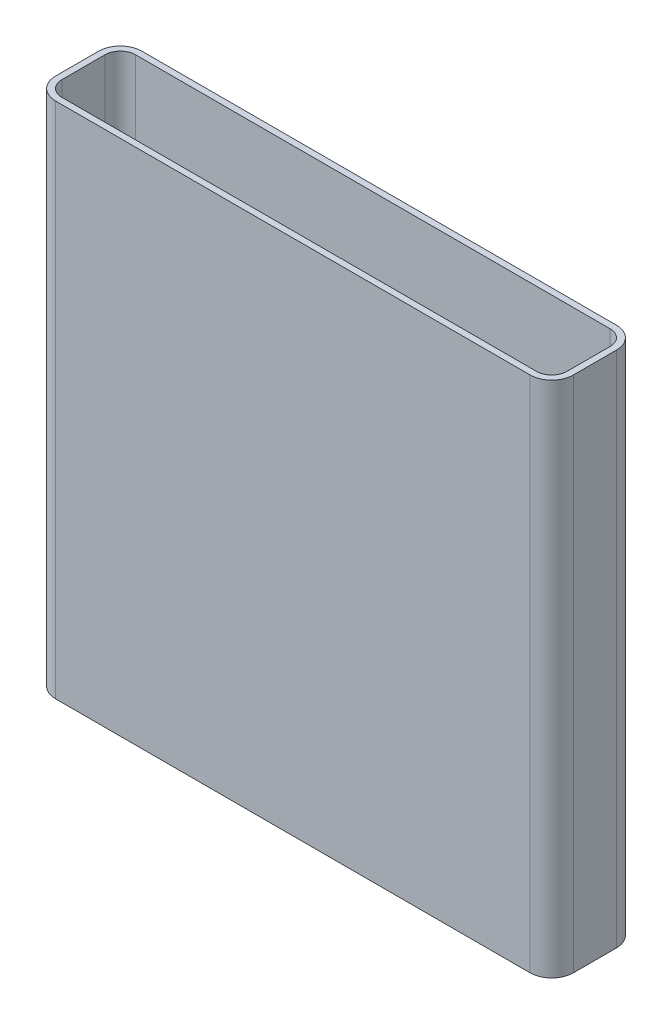
ISO-10303-21;
HEADER;
FILE_DESCRIPTION(('STEP AP214'),'2;1');
FILE_NAME('part.step','',(''),(''),'','','');
FILE_SCHEMA(('AUTOMOTIVE_DESIGN { 1 0 10303 214 1 1 1 1 }'));
ENDSEC;
DATA;
#1=APPLICATION_CONTEXT('core data for automotive mechanical design processes');
#2=APPLICATION_PROTOCOL_DEFINITION('international standard','automotive_design',2000,#1);
#3=PRODUCT_CONTEXT('',#1,'mechanical');
#4=PRODUCT('Part','Part','',(#3));
#5=PRODUCT_RELATED_PRODUCT_CATEGORY('part','',(#4));
#6=PRODUCT_DEFINITION_FORMATION('','',#4);
#7=PRODUCT_DEFINITION_CONTEXT('part definition',#1,'design');
#8=PRODUCT_DEFINITION('design','',#6,#7);
#9=PRODUCT_DEFINITION_SHAPE('','',#8);
#10=(LENGTH_UNIT() NAMED_UNIT(*) SI_UNIT(.MILLI.,.METRE.));
#11=(NAMED_UNIT(*) PLANE_ANGLE_UNIT() SI_UNIT($,.RADIAN.));
#12=(NAMED_UNIT(*) SI_UNIT($,.STERADIAN.) SOLID_ANGLE_UNIT());
#13=UNCERTAINTY_MEASURE_WITH_UNIT(LENGTH_MEASURE(1.E-05),#10,'distance_accuracy_value','');
#14=(GEOMETRIC_REPRESENTATION_CONTEXT(3) GLOBAL_UNCERTAINTY_ASSIGNED_CONTEXT((#13)) GLOBAL_UNIT_ASSIGNED_CONTEXT((#10,
#11,#12)) REPRESENTATION_CONTEXT('',''));
#15=CARTESIAN_POINT('',(0.,0.,0.));
#16=DIRECTION('',(0.,0.,1.));
#17=DIRECTION('',(1.,0.,0.));
#18=AXIS2_PLACEMENT_3D('',#15,#16,#17);
#19=CARTESIAN_POINT('',(838.2,1828.8,-76.2));
#20=DIRECTION('',(0.,1.,0.));
#21=DIRECTION('',(0.,0.,1.));
#22=AXIS2_PLACEMENT_3D('',#19,#20,#21);
#23=PLANE('',#22);
#24=CARTESIAN_POINT('',(838.2,1828.8,-76.2));
#25=DIRECTION('',(0.,1.,0.));
#26=DIRECTION('',(0.,0.,-1.));
#27=AXIS2_PLACEMENT_3D('',#24,#25,#26);
#28=CIRCLE('',#27,76.2);
#29=CARTESIAN_POINT('',(914.4,1828.8,-76.1999999999995));
#30=VERTEX_POINT('',#29);
#31=CARTESIAN_POINT('',(838.2,1828.8,-152.4));
#32=VERTEX_POINT('',#31);
#33=EDGE_CURVE('E290',#30,#32,#28,.T.);
#34=ORIENTED_EDGE('',*,*,#33,.T.);
#35=DIRECTION('',(-1.,0.,0.));
#36=VECTOR('',#35,1.);
#37=CARTESIAN_POINT('',(-838.199999999999,1828.8,-152.4));
#38=LINE('',#37,#36);
#39=CARTESIAN_POINT('',(-838.199999999999,1828.8,-152.4));
#40=VERTEX_POINT('',#39);
#41=EDGE_CURVE('E294',#32,#40,#38,.T.);
#42=ORIENTED_EDGE('',*,*,#41,.T.);
#43=CARTESIAN_POINT('',(-838.2,1828.8,-76.2));
#44=DIRECTION('',(0.,1.,0.));
#45=DIRECTION('',(0.,0.,1.));
#46=AXIS2_PLACEMENT_3D('',#43,#44,#45);
#47=CIRCLE('',#46,76.2);
#48=CARTESIAN_POINT('',(-914.4,1828.8,-76.1999999999995));
#49=VERTEX_POINT('',#48);
#50=EDGE_CURVE('E298',#40,#49,#47,.T.);
#51=ORIENTED_EDGE('',*,*,#50,.T.);
#52=DIRECTION('',(0.,0.,1.));
#53=VECTOR('',#52,1.);
#54=CARTESIAN_POINT('',(-914.4,1828.8,-76.1999999999995));
#55=LINE('',#54,#53);
#56=CARTESIAN_POINT('',(-914.4,1828.8,76.1999999999995));
#57=VERTEX_POINT('',#56);
#58=EDGE_CURVE('E301',#49,#57,#55,.T.);
#59=ORIENTED_EDGE('',*,*,#58,.T.);
#60=CARTESIAN_POINT('',(-838.199999999999,1828.8,76.2));
#61=DIRECTION('',(0.,1.,0.));
#62=DIRECTION('',(0.,0.,1.));
#63=AXIS2_PLACEMENT_3D('',#60,#61,#62);
#64=CIRCLE('',#63,76.2);
#65=CARTESIAN_POINT('',(-838.199999999999,1828.8,152.4));
#66=VERTEX_POINT('',#65);
#67=EDGE_CURVE('E304',#57,#66,#64,.T.);
#68=ORIENTED_EDGE('',*,*,#67,.T.);
#69=DIRECTION('',(1.,0.,0.));
#70=VECTOR('',#69,1.);
#71=CARTESIAN_POINT('',(-838.199999999999,1828.8,152.4));
#72=LINE('',#71,#70);
#73=CARTESIAN_POINT('',(838.2,1828.8,152.4));
#74=VERTEX_POINT('',#73);
#75=EDGE_CURVE('E307',#66,#74,#72,.T.);
#76=ORIENTED_EDGE('',*,*,#75,.T.);
#77=CARTESIAN_POINT('',(838.200000000001,1828.8,76.2));
#78=DIRECTION('',(0.,1.,0.));
#79=DIRECTION('',(0.,0.,1.));
#80=AXIS2_PLACEMENT_3D('',#77,#78,#79);
#81=CIRCLE('',#80,76.2);
#82=CARTESIAN_POINT('',(914.4,1828.8,76.1999999999995));
#83=VERTEX_POINT('',#82);
#84=EDGE_CURVE('E310',#74,#83,#81,.T.);
#85=ORIENTED_EDGE('',*,*,#84,.T.);
#86=DIRECTION('',(0.,0.,-1.));
#87=VECTOR('',#86,1.);
#88=CARTESIAN_POINT('',(914.4,1828.8,-76.1999999999995));
#89=LINE('',#88,#87);
#90=EDGE_CURVE('E313',#83,#30,#89,.T.);
#91=ORIENTED_EDGE('',*,*,#90,.T.);
#92=EDGE_LOOP('',(#34,#42,#51,#59,#68,#76,#85,#91));
#93=FACE_BOUND('',#92,.T.);
#94=DIRECTION('',(-1.,0.,0.));
#95=VECTOR('',#94,1.);
#96=CARTESIAN_POINT('',(838.2,1828.8,-130.175));
#97=LINE('',#96,#95);
#98=CARTESIAN_POINT('',(838.2,1828.8,-130.175));
#99=VERTEX_POINT('',#98);
#100=CARTESIAN_POINT('',(-838.199999999999,1828.8,-130.175));
#101=VERTEX_POINT('',#100);
#102=EDGE_CURVE('E210',#99,#101,#97,.T.);
#103=ORIENTED_EDGE('',*,*,#102,.F.);
#104=CARTESIAN_POINT('',(838.2,1828.8,-76.2));
#105=DIRECTION('',(0.,-1.,0.));
#106=DIRECTION('',(-1.,0.,0.));
#107=AXIS2_PLACEMENT_3D('',#104,#105,#106);
#108=CIRCLE('',#107,53.975);
#109=CARTESIAN_POINT('',(892.175,1828.8,-76.1999999999995));
#110=VERTEX_POINT('',#109);
#111=EDGE_CURVE('E201',#110,#99,#108,.F.);
#112=ORIENTED_EDGE('',*,*,#111,.F.);
#113=DIRECTION('',(0.,0.,-1.));
#114=VECTOR('',#113,1.);
#115=CARTESIAN_POINT('',(892.175,1828.8,-76.2));
#116=LINE('',#115,#114);
#117=CARTESIAN_POINT('',(892.175,1828.8,76.1999999999996));
#118=VERTEX_POINT('',#117);
#119=EDGE_CURVE('E242',#118,#110,#116,.T.);
#120=ORIENTED_EDGE('',*,*,#119,.F.);
#121=CARTESIAN_POINT('',(838.200000000001,1828.8,76.2));
#122=DIRECTION('',(0.,-1.,0.));
#123=DIRECTION('',(-1.,0.,0.));
#124=AXIS2_PLACEMENT_3D('',#121,#122,#123);
#125=CIRCLE('',#124,53.975);
#126=CARTESIAN_POINT('',(838.2,1828.8,130.175));
#127=VERTEX_POINT('',#126);
#128=EDGE_CURVE('E239',#127,#118,#125,.F.);
#129=ORIENTED_EDGE('',*,*,#128,.F.);
#130=DIRECTION('',(1.,0.,0.));
#131=VECTOR('',#130,1.);
#132=CARTESIAN_POINT('',(838.2,1828.8,130.175));
#133=LINE('',#132,#131);
#134=CARTESIAN_POINT('',(-838.199999999999,1828.8,130.175));
#135=VERTEX_POINT('',#134);
#136=EDGE_CURVE('E236',#135,#127,#133,.T.);
#137=ORIENTED_EDGE('',*,*,#136,.F.);
#138=CARTESIAN_POINT('',(-838.199999999999,1828.8,76.2));
#139=DIRECTION('',(0.,-1.,0.));
#140=DIRECTION('',(-1.,0.,0.));
#141=AXIS2_PLACEMENT_3D('',#138,#139,#140);
#142=CIRCLE('',#141,53.975);
#143=CARTESIAN_POINT('',(-892.174999999999,1828.8,76.1999999999995));
#144=VERTEX_POINT('',#143);
#145=EDGE_CURVE('E233',#144,#135,#142,.F.);
#146=ORIENTED_EDGE('',*,*,#145,.F.);
#147=DIRECTION('',(0.,0.,1.));
#148=VECTOR('',#147,1.);
#149=CARTESIAN_POINT('',(-892.175,1828.8,-76.2));
#150=LINE('',#149,#148);
#151=CARTESIAN_POINT('',(-892.175,1828.8,-76.1999999999996));
#152=VERTEX_POINT('',#151);
#153=EDGE_CURVE('E228',#152,#144,#150,.T.);
#154=ORIENTED_EDGE('',*,*,#153,.F.);
#155=CARTESIAN_POINT('',(-838.2,1828.8,-76.2));
#156=DIRECTION('',(0.,-1.,0.));
#157=DIRECTION('',(-1.,0.,0.));
#158=AXIS2_PLACEMENT_3D('',#155,#156,#157);
#159=CIRCLE('',#158,53.975);
#160=EDGE_CURVE('E224',#101,#152,#159,.F.);
#161=ORIENTED_EDGE('',*,*,#160,.F.);
#162=EDGE_LOOP('',(#103,#112,#120,#129,#137,#146,#154,#161));
#163=FACE_BOUND('',#162,.T.);
#164=ADVANCED_FACE('F87',(#93,#163),#23,.T.);
#165=CARTESIAN_POINT('',(838.2,0.,-76.2));
#166=DIRECTION('',(0.,1.,0.));
#167=DIRECTION('',(0.,0.,1.));
#168=AXIS2_PLACEMENT_3D('',#165,#166,#167);
#169=PLANE('',#168);
#170=CARTESIAN_POINT('',(838.2,0.,-76.2));
#171=DIRECTION('',(0.,1.,0.));
#172=DIRECTION('',(0.,0.,-1.));
#173=AXIS2_PLACEMENT_3D('',#170,#171,#172);
#174=CIRCLE('',#173,76.2);
#175=CARTESIAN_POINT('',(914.4,0.,-76.1999999999995));
#176=VERTEX_POINT('',#175);
#177=CARTESIAN_POINT('',(838.2,0.,-152.4));
#178=VERTEX_POINT('',#177);
#179=EDGE_CURVE('E219',#176,#178,#174,.T.);
#180=ORIENTED_EDGE('',*,*,#179,.F.);
#181=DIRECTION('',(0.,0.,-1.));
#182=VECTOR('',#181,1.);
#183=CARTESIAN_POINT('',(914.4,0.,-76.1999999999995));
#184=LINE('',#183,#182);
#185=CARTESIAN_POINT('',(914.4,0.,76.1999999999995));
#186=VERTEX_POINT('',#185);
#187=EDGE_CURVE('E295',#186,#176,#184,.T.);
#188=ORIENTED_EDGE('',*,*,#187,.F.);
#189=CARTESIAN_POINT('',(838.200000000001,0.,76.2));
#190=DIRECTION('',(0.,1.,0.));
#191=DIRECTION('',(0.,0.,1.));
#192=AXIS2_PLACEMENT_3D('',#189,#190,#191);
#193=CIRCLE('',#192,76.2);
#194=CARTESIAN_POINT('',(838.2,0.,152.4));
#195=VERTEX_POINT('',#194);
#196=EDGE_CURVE('E335',#195,#186,#193,.T.);
#197=ORIENTED_EDGE('',*,*,#196,.F.);
#198=DIRECTION('',(1.,0.,0.));
#199=VECTOR('',#198,1.);
#200=CARTESIAN_POINT('',(-838.199999999999,0.,152.4));
#201=LINE('',#200,#199);
#202=CARTESIAN_POINT('',(-838.199999999999,0.,152.4));
#203=VERTEX_POINT('',#202);
#204=EDGE_CURVE('E332',#203,#195,#201,.T.);
#205=ORIENTED_EDGE('',*,*,#204,.F.);
#206=CARTESIAN_POINT('',(-838.199999999999,0.,76.2));
#207=DIRECTION('',(0.,1.,0.));
#208=DIRECTION('',(0.,0.,1.));
#209=AXIS2_PLACEMENT_3D('',#206,#207,#208);
#210=CIRCLE('',#209,76.2);
#211=CARTESIAN_POINT('',(-914.4,0.,76.1999999999995));
#212=VERTEX_POINT('',#211);
#213=EDGE_CURVE('E329',#212,#203,#210,.T.);
#214=ORIENTED_EDGE('',*,*,#213,.F.);
#215=DIRECTION('',(0.,0.,1.));
#216=VECTOR('',#215,1.);
#217=CARTESIAN_POINT('',(-914.4,0.,-76.1999999999995));
#218=LINE('',#217,#216);
#219=CARTESIAN_POINT('',(-914.4,0.,-76.1999999999995));
#220=VERTEX_POINT('',#219);
#221=EDGE_CURVE('E326',#220,#212,#218,.T.);
#222=ORIENTED_EDGE('',*,*,#221,.F.);
#223=CARTESIAN_POINT('',(-838.2,0.,-76.2));
#224=DIRECTION('',(0.,1.,0.));
#225=DIRECTION('',(0.,0.,1.));
#226=AXIS2_PLACEMENT_3D('',#223,#224,#225);
#227=CIRCLE('',#226,76.2);
#228=CARTESIAN_POINT('',(-838.199999999999,0.,-152.4));
#229=VERTEX_POINT('',#228);
#230=EDGE_CURVE('E323',#229,#220,#227,.T.);
#231=ORIENTED_EDGE('',*,*,#230,.F.);
#232=DIRECTION('',(-1.,0.,0.));
#233=VECTOR('',#232,1.);
#234=CARTESIAN_POINT('',(-838.199999999999,0.,-152.4));
#235=LINE('',#234,#233);
#236=EDGE_CURVE('E320',#178,#229,#235,.T.);
#237=ORIENTED_EDGE('',*,*,#236,.F.);
#238=EDGE_LOOP('',(#180,#188,#197,#205,#214,#222,#231,#237));
#239=FACE_BOUND('',#238,.T.);
#240=CARTESIAN_POINT('',(838.2,0.,-76.2));
#241=DIRECTION('',(0.,-1.,0.));
#242=DIRECTION('',(-1.,0.,0.));
#243=AXIS2_PLACEMENT_3D('',#240,#241,#242);
#244=CIRCLE('',#243,53.975);
#245=CARTESIAN_POINT('',(892.175,0.,-76.1999999999995));
#246=VERTEX_POINT('',#245);
#247=CARTESIAN_POINT('',(838.2,0.,-130.175));
#248=VERTEX_POINT('',#247);
#249=EDGE_CURVE('E111',#246,#248,#244,.F.);
#250=ORIENTED_EDGE('',*,*,#249,.T.);
#251=DIRECTION('',(-1.,0.,0.));
#252=VECTOR('',#251,1.);
#253=CARTESIAN_POINT('',(838.2,0.,-130.175));
#254=LINE('',#253,#252);
#255=CARTESIAN_POINT('',(-838.199999999999,0.,-130.175));
#256=VERTEX_POINT('',#255);
#257=EDGE_CURVE('E217',#248,#256,#254,.T.);
#258=ORIENTED_EDGE('',*,*,#257,.T.);
#259=CARTESIAN_POINT('',(-838.2,0.,-76.2));
#260=DIRECTION('',(0.,-1.,0.));
#261=DIRECTION('',(-1.,0.,0.));
#262=AXIS2_PLACEMENT_3D('',#259,#260,#261);
#263=CIRCLE('',#262,53.975);
#264=CARTESIAN_POINT('',(-892.175,0.,-76.1999999999996));
#265=VERTEX_POINT('',#264);
#266=EDGE_CURVE('E249',#256,#265,#263,.F.);
#267=ORIENTED_EDGE('',*,*,#266,.T.);
#268=DIRECTION('',(0.,0.,1.));
#269=VECTOR('',#268,1.);
#270=CARTESIAN_POINT('',(-892.175,0.,-76.2));
#271=LINE('',#270,#269);
#272=CARTESIAN_POINT('',(-892.174999999999,0.,76.1999999999995));
#273=VERTEX_POINT('',#272);
#274=EDGE_CURVE('E253',#265,#273,#271,.T.);
#275=ORIENTED_EDGE('',*,*,#274,.T.);
#276=CARTESIAN_POINT('',(-838.199999999999,0.,76.2));
#277=DIRECTION('',(0.,-1.,0.));
#278=DIRECTION('',(-1.,0.,0.));
#279=AXIS2_PLACEMENT_3D('',#276,#277,#278);
#280=CIRCLE('',#279,53.975);
#281=CARTESIAN_POINT('',(-838.199999999999,0.,130.175));
#282=VERTEX_POINT('',#281);
#283=EDGE_CURVE('E257',#273,#282,#280,.F.);
#284=ORIENTED_EDGE('',*,*,#283,.T.);
#285=DIRECTION('',(1.,0.,0.));
#286=VECTOR('',#285,1.);
#287=CARTESIAN_POINT('',(838.2,0.,130.175));
#288=LINE('',#287,#286);
#289=CARTESIAN_POINT('',(838.2,0.,130.175));
#290=VERTEX_POINT('',#289);
#291=EDGE_CURVE('E261',#282,#290,#288,.T.);
#292=ORIENTED_EDGE('',*,*,#291,.T.);
#293=CARTESIAN_POINT('',(838.200000000001,0.,76.2));
#294=DIRECTION('',(0.,-1.,0.));
#295=DIRECTION('',(-1.,0.,0.));
#296=AXIS2_PLACEMENT_3D('',#293,#294,#295);
#297=CIRCLE('',#296,53.975);
#298=CARTESIAN_POINT('',(892.175000000001,0.,76.1999999999996));
#299=VERTEX_POINT('',#298);
#300=EDGE_CURVE('E265',#290,#299,#297,.F.);
#301=ORIENTED_EDGE('',*,*,#300,.T.);
#302=DIRECTION('',(0.,0.,-1.));
#303=VECTOR('',#302,1.);
#304=CARTESIAN_POINT('',(892.175,0.,-76.2));
#305=LINE('',#304,#303);
#306=EDGE_CURVE('E211',#299,#246,#305,.T.);
#307=ORIENTED_EDGE('',*,*,#306,.T.);
#308=EDGE_LOOP('',(#250,#258,#267,#275,#284,#292,#301,#307));
#309=FACE_BOUND('',#308,.T.);
#310=ADVANCED_FACE('F374',(#239,#309),#169,.F.);
#311=CARTESIAN_POINT('',(838.2,1828.8,-76.2));
#312=DIRECTION('',(0.,-1.,0.));
#313=DIRECTION('',(0.,0.,-1.));
#314=AXIS2_PLACEMENT_3D('',#311,#312,#313);
#315=CYLINDRICAL_SURFACE('',#314,76.2);
#316=ORIENTED_EDGE('',*,*,#179,.T.);
#317=DIRECTION('',(0.,-1.,0.));
#318=VECTOR('',#317,1.);
#319=CARTESIAN_POINT('',(838.2,1828.8,-152.4));
#320=LINE('',#319,#318);
#321=EDGE_CURVE('E12',#32,#178,#320,.T.);
#322=ORIENTED_EDGE('',*,*,#321,.F.);
#323=ORIENTED_EDGE('',*,*,#33,.F.);
#324=DIRECTION('',(0.,-1.,0.));
#325=VECTOR('',#324,1.);
#326=CARTESIAN_POINT('',(914.4,1828.8,-76.1999999999995));
#327=LINE('',#326,#325);
#328=EDGE_CURVE('E316',#30,#176,#327,.T.);
#329=ORIENTED_EDGE('',*,*,#328,.T.);
#330=EDGE_LOOP('',(#316,#322,#323,#329));
#331=FACE_BOUND('',#330,.T.);
#332=ADVANCED_FACE('F89',(#331),#315,.T.);
#333=CARTESIAN_POINT('',(-838.199999999999,1828.8,-152.4));
#334=DIRECTION('',(0.,0.,1.));
#335=DIRECTION('',(1.,0.,0.));
#336=AXIS2_PLACEMENT_3D('',#333,#334,#335);
#337=PLANE('',#336);
#338=ORIENTED_EDGE('',*,*,#236,.T.);
#339=DIRECTION('',(0.,-1.,0.));
#340=VECTOR('',#339,1.);
#341=CARTESIAN_POINT('',(-838.199999999999,1828.8,-152.4));
#342=LINE('',#341,#340);
#343=EDGE_CURVE('E96',#40,#229,#342,.T.);
#344=ORIENTED_EDGE('',*,*,#343,.F.);
#345=ORIENTED_EDGE('',*,*,#41,.F.);
#346=ORIENTED_EDGE('',*,*,#321,.T.);
#347=EDGE_LOOP('',(#338,#344,#345,#346));
#348=FACE_BOUND('',#347,.T.);
#349=ADVANCED_FACE('F391',(#348),#337,.F.);
#350=CARTESIAN_POINT('',(-838.2,1828.8,-76.2));
#351=DIRECTION('',(0.,-1.,0.));
#352=DIRECTION('',(0.,0.,-1.));
#353=AXIS2_PLACEMENT_3D('',#350,#351,#352);
#354=CYLINDRICAL_SURFACE('',#353,76.2);
#355=ORIENTED_EDGE('',*,*,#230,.T.);
#356=DIRECTION('',(0.,-1.,0.));
#357=VECTOR('',#356,1.);
#358=CARTESIAN_POINT('',(-914.4,1828.8,-76.1999999999995));
#359=LINE('',#358,#357);
#360=EDGE_CURVE('E359',#49,#220,#359,.T.);
#361=ORIENTED_EDGE('',*,*,#360,.F.);
#362=ORIENTED_EDGE('',*,*,#50,.F.);
#363=ORIENTED_EDGE('',*,*,#343,.T.);
#364=EDGE_LOOP('',(#355,#361,#362,#363));
#365=FACE_BOUND('',#364,.T.);
#366=ADVANCED_FACE('F368',(#365),#354,.T.);
#367=CARTESIAN_POINT('',(-914.4,1828.8,-76.1999999999995));
#368=DIRECTION('',(1.,0.,0.));
#369=DIRECTION('',(0.,0.,-1.));
#370=AXIS2_PLACEMENT_3D('',#367,#368,#369);
#371=PLANE('',#370);
#372=ORIENTED_EDGE('',*,*,#221,.T.);
#373=DIRECTION('',(0.,-1.,0.));
#374=VECTOR('',#373,1.);
#375=CARTESIAN_POINT('',(-914.4,1828.8,76.1999999999995));
#376=LINE('',#375,#374);
#377=EDGE_CURVE('E355',#57,#212,#376,.T.);
#378=ORIENTED_EDGE('',*,*,#377,.F.);
#379=ORIENTED_EDGE('',*,*,#58,.F.);
#380=ORIENTED_EDGE('',*,*,#360,.T.);
#381=EDGE_LOOP('',(#372,#378,#379,#380));
#382=FACE_BOUND('',#381,.T.);
#383=ADVANCED_FACE('F380',(#382),#371,.F.);
#384=CARTESIAN_POINT('',(-838.199999999999,1828.8,76.2));
#385=DIRECTION('',(0.,-1.,0.));
#386=DIRECTION('',(0.,0.,-1.));
#387=AXIS2_PLACEMENT_3D('',#384,#385,#386);
#388=CYLINDRICAL_SURFACE('',#387,76.2);
#389=ORIENTED_EDGE('',*,*,#213,.T.);
#390=DIRECTION('',(0.,-1.,0.));
#391=VECTOR('',#390,1.);
#392=CARTESIAN_POINT('',(-838.199999999999,1828.8,152.4));
#393=LINE('',#392,#391);
#394=EDGE_CURVE('E351',#66,#203,#393,.T.);
#395=ORIENTED_EDGE('',*,*,#394,.F.);
#396=ORIENTED_EDGE('',*,*,#67,.F.);
#397=ORIENTED_EDGE('',*,*,#377,.T.);
#398=EDGE_LOOP('',(#389,#395,#396,#397));
#399=FACE_BOUND('',#398,.T.);
#400=ADVANCED_FACE('F384',(#399),#388,.T.);
#401=CARTESIAN_POINT('',(-838.199999999999,1828.8,152.4));
#402=DIRECTION('',(0.,0.,-1.));
#403=DIRECTION('',(-1.,0.,0.));
#404=AXIS2_PLACEMENT_3D('',#401,#402,#403);
#405=PLANE('',#404);
#406=ORIENTED_EDGE('',*,*,#204,.T.);
#407=DIRECTION('',(0.,-1.,0.));
#408=VECTOR('',#407,1.);
#409=CARTESIAN_POINT('',(838.2,1828.8,152.4));
#410=LINE('',#409,#408);
#411=EDGE_CURVE('E347',#74,#195,#410,.T.);
#412=ORIENTED_EDGE('',*,*,#411,.F.);
#413=ORIENTED_EDGE('',*,*,#75,.F.);
#414=ORIENTED_EDGE('',*,*,#394,.T.);
#415=EDGE_LOOP('',(#406,#412,#413,#414));
#416=FACE_BOUND('',#415,.T.);
#417=ADVANCED_FACE('F404',(#416),#405,.F.);
#418=CARTESIAN_POINT('',(838.200000000001,1828.8,76.2));
#419=DIRECTION('',(0.,-1.,0.));
#420=DIRECTION('',(0.,0.,-1.));
#421=AXIS2_PLACEMENT_3D('',#418,#419,#420);
#422=CYLINDRICAL_SURFACE('',#421,76.2);
#423=ORIENTED_EDGE('',*,*,#196,.T.);
#424=DIRECTION('',(0.,-1.,0.));
#425=VECTOR('',#424,1.);
#426=CARTESIAN_POINT('',(914.4,1828.8,76.1999999999995));
#427=LINE('',#426,#425);
#428=EDGE_CURVE('E343',#83,#186,#427,.T.);
#429=ORIENTED_EDGE('',*,*,#428,.F.);
#430=ORIENTED_EDGE('',*,*,#84,.F.);
#431=ORIENTED_EDGE('',*,*,#411,.T.);
#432=EDGE_LOOP('',(#423,#429,#430,#431));
#433=FACE_BOUND('',#432,.T.);
#434=ADVANCED_FACE('F402',(#433),#422,.T.);
#435=CARTESIAN_POINT('',(914.4,1828.8,-76.1999999999995));
#436=DIRECTION('',(-1.,0.,0.));
#437=DIRECTION('',(0.,0.,1.));
#438=AXIS2_PLACEMENT_3D('',#435,#436,#437);
#439=PLANE('',#438);
#440=ORIENTED_EDGE('',*,*,#187,.T.);
#441=ORIENTED_EDGE('',*,*,#328,.F.);
#442=ORIENTED_EDGE('',*,*,#90,.F.);
#443=ORIENTED_EDGE('',*,*,#428,.T.);
#444=EDGE_LOOP('',(#440,#441,#442,#443));
#445=FACE_BOUND('',#444,.T.);
#446=ADVANCED_FACE('F397',(#445),#439,.F.);
#447=CARTESIAN_POINT('',(838.2,1828.8,-76.2));
#448=DIRECTION('',(0.,-1.,0.));
#449=DIRECTION('',(0.,0.,-1.));
#450=AXIS2_PLACEMENT_3D('',#447,#448,#449);
#451=CYLINDRICAL_SURFACE('',#450,53.975);
#452=ORIENTED_EDGE('',*,*,#249,.F.);
#453=DIRECTION('',(0.,-1.,0.));
#454=VECTOR('',#453,1.);
#455=CARTESIAN_POINT('',(892.175,1828.8,-76.1999999999995));
#456=LINE('',#455,#454);
#457=EDGE_CURVE('E205',#110,#246,#456,.T.);
#458=ORIENTED_EDGE('',*,*,#457,.F.);
#459=ORIENTED_EDGE('',*,*,#111,.T.);
#460=DIRECTION('',(0.,-1.,0.));
#461=VECTOR('',#460,1.);
#462=CARTESIAN_POINT('',(838.2,1828.8,-130.175));
#463=LINE('',#462,#461);
#464=EDGE_CURVE('E204',#99,#248,#463,.T.);
#465=ORIENTED_EDGE('',*,*,#464,.T.);
#466=EDGE_LOOP('',(#452,#458,#459,#465));
#467=FACE_BOUND('',#466,.T.);
#468=ADVANCED_FACE('F203',(#467),#451,.F.);
#469=CARTESIAN_POINT('',(838.2,1828.8,-130.175));
#470=DIRECTION('',(0.,0.,1.));
#471=DIRECTION('',(1.,0.,0.));
#472=AXIS2_PLACEMENT_3D('',#469,#470,#471);
#473=PLANE('',#472);
#474=ORIENTED_EDGE('',*,*,#257,.F.);
#475=ORIENTED_EDGE('',*,*,#464,.F.);
#476=ORIENTED_EDGE('',*,*,#102,.T.);
#477=DIRECTION('',(0.,-1.,0.));
#478=VECTOR('',#477,1.);
#479=CARTESIAN_POINT('',(-838.199999999999,1828.8,-130.175));
#480=LINE('',#479,#478);
#481=EDGE_CURVE('E220',#101,#256,#480,.T.);
#482=ORIENTED_EDGE('',*,*,#481,.T.);
#483=EDGE_LOOP('',(#474,#475,#476,#482));
#484=FACE_BOUND('',#483,.T.);
#485=ADVANCED_FACE('F214',(#484),#473,.T.);
#486=CARTESIAN_POINT('',(-838.2,1828.8,-76.2));
#487=DIRECTION('',(0.,-1.,0.));
#488=DIRECTION('',(0.,0.,-1.));
#489=AXIS2_PLACEMENT_3D('',#486,#487,#488);
#490=CYLINDRICAL_SURFACE('',#489,53.975);
#491=ORIENTED_EDGE('',*,*,#266,.F.);
#492=ORIENTED_EDGE('',*,*,#481,.F.);
#493=ORIENTED_EDGE('',*,*,#160,.T.);
#494=DIRECTION('',(0.,-1.,0.));
#495=VECTOR('',#494,1.);
#496=CARTESIAN_POINT('',(-892.175,1828.8,-76.1999999999996));
#497=LINE('',#496,#495);
#498=EDGE_CURVE('E285',#152,#265,#497,.T.);
#499=ORIENTED_EDGE('',*,*,#498,.T.);
#500=EDGE_LOOP('',(#491,#492,#493,#499));
#501=FACE_BOUND('',#500,.T.);
#502=ADVANCED_FACE('F429',(#501),#490,.F.);
#503=CARTESIAN_POINT('',(-892.175,1828.8,-76.2));
#504=DIRECTION('',(1.,0.,0.));
#505=DIRECTION('',(0.,0.,-1.));
#506=AXIS2_PLACEMENT_3D('',#503,#504,#505);
#507=PLANE('',#506);
#508=ORIENTED_EDGE('',*,*,#274,.F.);
#509=ORIENTED_EDGE('',*,*,#498,.F.);
#510=ORIENTED_EDGE('',*,*,#153,.T.);
#511=DIRECTION('',(0.,-1.,0.));
#512=VECTOR('',#511,1.);
#513=CARTESIAN_POINT('',(-892.174999999999,1828.8,76.1999999999995));
#514=LINE('',#513,#512);
#515=EDGE_CURVE('E282',#144,#273,#514,.T.);
#516=ORIENTED_EDGE('',*,*,#515,.T.);
#517=EDGE_LOOP('',(#508,#509,#510,#516));
#518=FACE_BOUND('',#517,.T.);
#519=ADVANCED_FACE('F433',(#518),#507,.T.);
#520=CARTESIAN_POINT('',(-838.199999999999,1828.8,76.2));
#521=DIRECTION('',(0.,-1.,0.));
#522=DIRECTION('',(0.,0.,-1.));
#523=AXIS2_PLACEMENT_3D('',#520,#521,#522);
#524=CYLINDRICAL_SURFACE('',#523,53.975);
#525=ORIENTED_EDGE('',*,*,#283,.F.);
#526=ORIENTED_EDGE('',*,*,#515,.F.);
#527=ORIENTED_EDGE('',*,*,#145,.T.);
#528=DIRECTION('',(0.,-1.,0.));
#529=VECTOR('',#528,1.);
#530=CARTESIAN_POINT('',(-838.199999999999,1828.8,130.175));
#531=LINE('',#530,#529);
#532=EDGE_CURVE('E279',#135,#282,#531,.T.);
#533=ORIENTED_EDGE('',*,*,#532,.T.);
#534=EDGE_LOOP('',(#525,#526,#527,#533));
#535=FACE_BOUND('',#534,.T.);
#536=ADVANCED_FACE('F439',(#535),#524,.F.);
#537=CARTESIAN_POINT('',(838.2,1828.8,130.175));
#538=DIRECTION('',(0.,0.,-1.));
#539=DIRECTION('',(-1.,0.,0.));
#540=AXIS2_PLACEMENT_3D('',#537,#538,#539);
#541=PLANE('',#540);
#542=ORIENTED_EDGE('',*,*,#291,.F.);
#543=ORIENTED_EDGE('',*,*,#532,.F.);
#544=ORIENTED_EDGE('',*,*,#136,.T.);
#545=DIRECTION('',(0.,-1.,0.));
#546=VECTOR('',#545,1.);
#547=CARTESIAN_POINT('',(838.2,1828.8,130.175));
#548=LINE('',#547,#546);
#549=EDGE_CURVE('E276',#127,#290,#548,.T.);
#550=ORIENTED_EDGE('',*,*,#549,.T.);
#551=EDGE_LOOP('',(#542,#543,#544,#550));
#552=FACE_BOUND('',#551,.T.);
#553=ADVANCED_FACE('F443',(#552),#541,.T.);
#554=CARTESIAN_POINT('',(838.200000000001,1828.8,76.2));
#555=DIRECTION('',(0.,-1.,0.));
#556=DIRECTION('',(0.,0.,-1.));
#557=AXIS2_PLACEMENT_3D('',#554,#555,#556);
#558=CYLINDRICAL_SURFACE('',#557,53.975);
#559=ORIENTED_EDGE('',*,*,#300,.F.);
#560=ORIENTED_EDGE('',*,*,#549,.F.);
#561=ORIENTED_EDGE('',*,*,#128,.T.);
#562=DIRECTION('',(0.,-1.,0.));
#563=VECTOR('',#562,1.);
#564=CARTESIAN_POINT('',(892.175000000001,1828.8,76.1999999999996));
#565=LINE('',#564,#563);
#566=EDGE_CURVE('E103',#118,#299,#565,.T.);
#567=ORIENTED_EDGE('',*,*,#566,.T.);
#568=EDGE_LOOP('',(#559,#560,#561,#567));
#569=FACE_BOUND('',#568,.T.);
#570=ADVANCED_FACE('F447',(#569),#558,.F.);
#571=CARTESIAN_POINT('',(892.175,1828.8,-76.2));
#572=DIRECTION('',(-1.,0.,0.));
#573=DIRECTION('',(0.,0.,1.));
#574=AXIS2_PLACEMENT_3D('',#571,#572,#573);
#575=PLANE('',#574);
#576=ORIENTED_EDGE('',*,*,#306,.F.);
#577=ORIENTED_EDGE('',*,*,#566,.F.);
#578=ORIENTED_EDGE('',*,*,#119,.T.);
#579=ORIENTED_EDGE('',*,*,#457,.T.);
#580=EDGE_LOOP('',(#576,#577,#578,#579));
#581=FACE_BOUND('',#580,.T.);
#582=ADVANCED_FACE('F451',(#581),#575,.T.);
#583=CLOSED_SHELL('',(#164,#310,#332,#349,#366,#383,#400,#417,#434,#446,#468,#485,#502,#519,
#536,#553,#570,#582));
#584=MANIFOLD_SOLID_BREP('B2',#583);
#585=ADVANCED_BREP_SHAPE_REPRESENTATION('',(#18,#584),#14);
#586=SHAPE_DEFINITION_REPRESENTATION(#9,#585);
ENDSEC;
END-ISO-10303-21;
